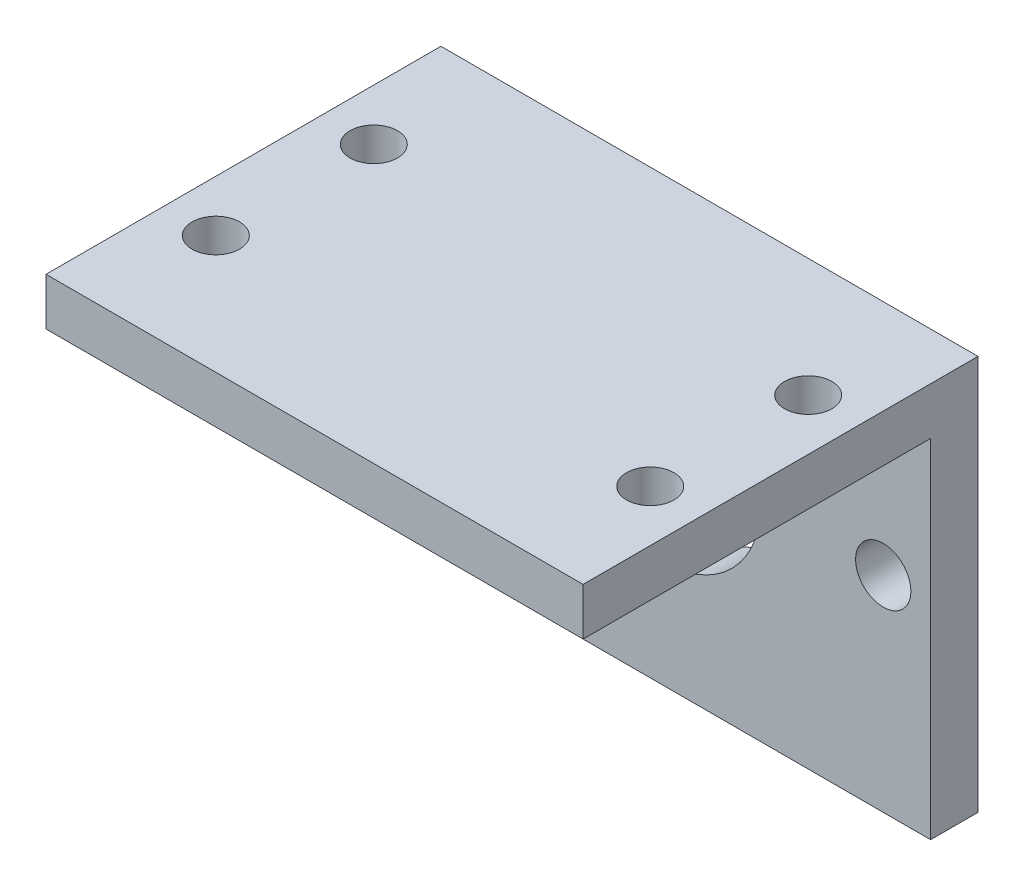
ISO-10303-21;
HEADER;
FILE_DESCRIPTION(('STEP AP214'),'2;1');
FILE_NAME('part.step','',(''),(''),'','','');
FILE_SCHEMA(('AUTOMOTIVE_DESIGN { 1 0 10303 214 1 1 1 1 }'));
ENDSEC;
DATA;
#1=APPLICATION_CONTEXT('core data for automotive mechanical design processes');
#2=APPLICATION_PROTOCOL_DEFINITION('international standard','automotive_design',2000,#1);
#3=PRODUCT_CONTEXT('',#1,'mechanical');
#4=PRODUCT('Part','Part','',(#3));
#5=PRODUCT_RELATED_PRODUCT_CATEGORY('part','',(#4));
#6=PRODUCT_DEFINITION_FORMATION('','',#4);
#7=PRODUCT_DEFINITION_CONTEXT('part definition',#1,'design');
#8=PRODUCT_DEFINITION('design','',#6,#7);
#9=PRODUCT_DEFINITION_SHAPE('','',#8);
#10=(LENGTH_UNIT() NAMED_UNIT(*) SI_UNIT(.MILLI.,.METRE.));
#11=(NAMED_UNIT(*) PLANE_ANGLE_UNIT() SI_UNIT($,.RADIAN.));
#12=(NAMED_UNIT(*) SI_UNIT($,.STERADIAN.) SOLID_ANGLE_UNIT());
#13=UNCERTAINTY_MEASURE_WITH_UNIT(LENGTH_MEASURE(1.E-05),#10,'distance_accuracy_value','');
#14=(GEOMETRIC_REPRESENTATION_CONTEXT(3) GLOBAL_UNCERTAINTY_ASSIGNED_CONTEXT((#13)) GLOBAL_UNIT_ASSIGNED_CONTEXT((#10,
#11,#12)) REPRESENTATION_CONTEXT('',''));
#15=CARTESIAN_POINT('',(0.,0.,0.));
#16=DIRECTION('',(0.,0.,1.));
#17=DIRECTION('',(1.,0.,0.));
#18=AXIS2_PLACEMENT_3D('',#15,#16,#17);
#19=CARTESIAN_POINT('',(0.,6.,0.));
#20=DIRECTION('',(0.,1.,0.));
#21=DIRECTION('',(0.,0.,1.));
#22=AXIS2_PLACEMENT_3D('',#19,#20,#21);
#23=PLANE('',#22);
#24=DIRECTION('',(0.,0.,-1.));
#25=VECTOR('',#24,1.);
#26=CARTESIAN_POINT('',(34.,6.,-50.));
#27=LINE('',#26,#25);
#28=CARTESIAN_POINT('',(34.,6.,0.));
#29=VERTEX_POINT('',#28);
#30=CARTESIAN_POINT('',(34.,6.,-50.));
#31=VERTEX_POINT('',#30);
#32=EDGE_CURVE('E155',#29,#31,#27,.T.);
#33=ORIENTED_EDGE('',*,*,#32,.T.);
#34=DIRECTION('',(-1.,0.,0.));
#35=VECTOR('',#34,1.);
#36=CARTESIAN_POINT('',(-34.,6.,-50.));
#37=LINE('',#36,#35);
#38=CARTESIAN_POINT('',(-34.,6.,-50.));
#39=VERTEX_POINT('',#38);
#40=EDGE_CURVE('E58',#31,#39,#37,.T.);
#41=ORIENTED_EDGE('',*,*,#40,.T.);
#42=DIRECTION('',(0.,0.,1.));
#43=VECTOR('',#42,1.);
#44=CARTESIAN_POINT('',(-34.,6.,-50.));
#45=LINE('',#44,#43);
#46=CARTESIAN_POINT('',(-34.,6.,0.));
#47=VERTEX_POINT('',#46);
#48=EDGE_CURVE('E78',#39,#47,#45,.T.);
#49=ORIENTED_EDGE('',*,*,#48,.T.);
#50=DIRECTION('',(1.,0.,0.));
#51=VECTOR('',#50,1.);
#52=CARTESIAN_POINT('',(-34.,6.,0.));
#53=LINE('',#52,#51);
#54=EDGE_CURVE('E152',#47,#29,#53,.T.);
#55=ORIENTED_EDGE('',*,*,#54,.T.);
#56=EDGE_LOOP('',(#33,#41,#49,#55));
#57=FACE_BOUND('',#56,.T.);
#58=CARTESIAN_POINT('',(-27.5,6.,-15.));
#59=DIRECTION('',(0.,1.,0.));
#60=DIRECTION('',(0.,0.,1.));
#61=AXIS2_PLACEMENT_3D('',#58,#59,#60);
#62=CIRCLE('',#61,3.);
#63=CARTESIAN_POINT('',(-27.5,6.,-12.));
#64=VERTEX_POINT('',#63);
#65=EDGE_CURVE('E133',#64,#64,#62,.T.);
#66=ORIENTED_EDGE('',*,*,#65,.F.);
#67=EDGE_LOOP('',(#66));
#68=FACE_BOUND('',#67,.T.);
#69=CARTESIAN_POINT('',(-27.5,6.,-35.));
#70=DIRECTION('',(0.,1.,0.));
#71=DIRECTION('',(0.,0.,1.));
#72=AXIS2_PLACEMENT_3D('',#69,#70,#71);
#73=CIRCLE('',#72,3.);
#74=CARTESIAN_POINT('',(-27.5,6.,-32.));
#75=VERTEX_POINT('',#74);
#76=EDGE_CURVE('E145',#75,#75,#73,.T.);
#77=ORIENTED_EDGE('',*,*,#76,.F.);
#78=EDGE_LOOP('',(#77));
#79=FACE_BOUND('',#78,.T.);
#80=CARTESIAN_POINT('',(27.5,6.,-35.));
#81=DIRECTION('',(0.,1.,0.));
#82=DIRECTION('',(0.,0.,1.));
#83=AXIS2_PLACEMENT_3D('',#80,#81,#82);
#84=CIRCLE('',#83,3.);
#85=CARTESIAN_POINT('',(27.5,6.,-32.));
#86=VERTEX_POINT('',#85);
#87=EDGE_CURVE('E139',#86,#86,#84,.T.);
#88=ORIENTED_EDGE('',*,*,#87,.F.);
#89=EDGE_LOOP('',(#88));
#90=FACE_BOUND('',#89,.T.);
#91=CARTESIAN_POINT('',(27.5,6.,-15.));
#92=DIRECTION('',(0.,1.,0.));
#93=DIRECTION('',(0.,0.,1.));
#94=AXIS2_PLACEMENT_3D('',#91,#92,#93);
#95=CIRCLE('',#94,3.);
#96=CARTESIAN_POINT('',(27.5,6.,-12.));
#97=VERTEX_POINT('',#96);
#98=EDGE_CURVE('E127',#97,#97,#95,.T.);
#99=ORIENTED_EDGE('',*,*,#98,.F.);
#100=EDGE_LOOP('',(#99));
#101=FACE_BOUND('',#100,.T.);
#102=ADVANCED_FACE('F34',(#57,#68,#79,#90,#101),#23,.T.);
#103=CARTESIAN_POINT('',(0.,0.,0.));
#104=DIRECTION('',(0.,1.,0.));
#105=DIRECTION('',(0.,0.,1.));
#106=AXIS2_PLACEMENT_3D('',#103,#104,#105);
#107=PLANE('',#106);
#108=CARTESIAN_POINT('',(-27.5,0.,-15.));
#109=DIRECTION('',(0.,1.,0.));
#110=DIRECTION('',(0.,0.,1.));
#111=AXIS2_PLACEMENT_3D('',#108,#109,#110);
#112=CIRCLE('',#111,3.);
#113=CARTESIAN_POINT('',(-27.5,0.,-12.));
#114=VERTEX_POINT('',#113);
#115=EDGE_CURVE('E130',#114,#114,#112,.T.);
#116=ORIENTED_EDGE('',*,*,#115,.T.);
#117=EDGE_LOOP('',(#116));
#118=FACE_BOUND('',#117,.T.);
#119=CARTESIAN_POINT('',(-27.5,0.,-35.));
#120=DIRECTION('',(0.,1.,0.));
#121=DIRECTION('',(0.,0.,1.));
#122=AXIS2_PLACEMENT_3D('',#119,#120,#121);
#123=CIRCLE('',#122,3.);
#124=CARTESIAN_POINT('',(-27.5,0.,-32.));
#125=VERTEX_POINT('',#124);
#126=EDGE_CURVE('E142',#125,#125,#123,.T.);
#127=ORIENTED_EDGE('',*,*,#126,.T.);
#128=EDGE_LOOP('',(#127));
#129=FACE_BOUND('',#128,.T.);
#130=DIRECTION('',(0.,0.,1.));
#131=VECTOR('',#130,1.);
#132=CARTESIAN_POINT('',(-34.,0.,-50.));
#133=LINE('',#132,#131);
#134=CARTESIAN_POINT('',(-34.,0.,-44.));
#135=VERTEX_POINT('',#134);
#136=CARTESIAN_POINT('',(-34.,0.,0.));
#137=VERTEX_POINT('',#136);
#138=EDGE_CURVE('E148',#135,#137,#133,.T.);
#139=ORIENTED_EDGE('',*,*,#138,.F.);
#140=DIRECTION('',(1.,0.,0.));
#141=VECTOR('',#140,1.);
#142=CARTESIAN_POINT('',(0.,0.,-44.));
#143=LINE('',#142,#141);
#144=CARTESIAN_POINT('',(34.,0.,-44.));
#145=VERTEX_POINT('',#144);
#146=EDGE_CURVE('E97',#135,#145,#143,.T.);
#147=ORIENTED_EDGE('',*,*,#146,.T.);
#148=DIRECTION('',(0.,0.,-1.));
#149=VECTOR('',#148,1.);
#150=CARTESIAN_POINT('',(34.,0.,-50.));
#151=LINE('',#150,#149);
#152=CARTESIAN_POINT('',(34.,0.,0.));
#153=VERTEX_POINT('',#152);
#154=EDGE_CURVE('E153',#153,#145,#151,.T.);
#155=ORIENTED_EDGE('',*,*,#154,.F.);
#156=DIRECTION('',(1.,0.,0.));
#157=VECTOR('',#156,1.);
#158=CARTESIAN_POINT('',(-34.,0.,0.));
#159=LINE('',#158,#157);
#160=EDGE_CURVE('E73',#137,#153,#159,.T.);
#161=ORIENTED_EDGE('',*,*,#160,.F.);
#162=EDGE_LOOP('',(#139,#147,#155,#161));
#163=FACE_BOUND('',#162,.T.);
#164=CARTESIAN_POINT('',(27.5,0.,-35.));
#165=DIRECTION('',(0.,1.,0.));
#166=DIRECTION('',(0.,0.,1.));
#167=AXIS2_PLACEMENT_3D('',#164,#165,#166);
#168=CIRCLE('',#167,3.);
#169=CARTESIAN_POINT('',(27.5,0.,-32.));
#170=VERTEX_POINT('',#169);
#171=EDGE_CURVE('E136',#170,#170,#168,.T.);
#172=ORIENTED_EDGE('',*,*,#171,.T.);
#173=EDGE_LOOP('',(#172));
#174=FACE_BOUND('',#173,.T.);
#175=CARTESIAN_POINT('',(27.5,0.,-15.));
#176=DIRECTION('',(0.,1.,0.));
#177=DIRECTION('',(0.,0.,1.));
#178=AXIS2_PLACEMENT_3D('',#175,#176,#177);
#179=CIRCLE('',#178,3.);
#180=CARTESIAN_POINT('',(27.5,0.,-12.));
#181=VERTEX_POINT('',#180);
#182=EDGE_CURVE('E126',#181,#181,#179,.T.);
#183=ORIENTED_EDGE('',*,*,#182,.T.);
#184=EDGE_LOOP('',(#183));
#185=FACE_BOUND('',#184,.T.);
#186=ADVANCED_FACE('F170',(#118,#129,#163,#174,#185),#107,.F.);
#187=CARTESIAN_POINT('',(-34.,6.,-50.));
#188=DIRECTION('',(1.,0.,0.));
#189=DIRECTION('',(0.,0.,-1.));
#190=AXIS2_PLACEMENT_3D('',#187,#188,#189);
#191=PLANE('',#190);
#192=DIRECTION('',(0.,-1.,0.));
#193=VECTOR('',#192,1.);
#194=CARTESIAN_POINT('',(-34.,6.,0.));
#195=LINE('',#194,#193);
#196=EDGE_CURVE('E11',#47,#137,#195,.T.);
#197=ORIENTED_EDGE('',*,*,#196,.F.);
#198=ORIENTED_EDGE('',*,*,#48,.F.);
#199=DIRECTION('',(0.,-1.,0.));
#200=VECTOR('',#199,1.);
#201=CARTESIAN_POINT('',(-34.,6.,-50.));
#202=LINE('',#201,#200);
#203=CARTESIAN_POINT('',(-34.,-44.,-50.));
#204=VERTEX_POINT('',#203);
#205=EDGE_CURVE('E114',#39,#204,#202,.T.);
#206=ORIENTED_EDGE('',*,*,#205,.T.);
#207=DIRECTION('',(0.,0.,1.));
#208=VECTOR('',#207,1.);
#209=CARTESIAN_POINT('',(-34.,-44.,-50.));
#210=LINE('',#209,#208);
#211=CARTESIAN_POINT('',(-34.,-44.,-44.));
#212=VERTEX_POINT('',#211);
#213=EDGE_CURVE('E108',#204,#212,#210,.T.);
#214=ORIENTED_EDGE('',*,*,#213,.T.);
#215=DIRECTION('',(0.,1.,0.));
#216=VECTOR('',#215,1.);
#217=CARTESIAN_POINT('',(-34.,-44.,-44.));
#218=LINE('',#217,#216);
#219=EDGE_CURVE('E93',#212,#135,#218,.T.);
#220=ORIENTED_EDGE('',*,*,#219,.T.);
#221=ORIENTED_EDGE('',*,*,#138,.T.);
#222=EDGE_LOOP('',(#197,#198,#206,#214,#220,#221));
#223=FACE_BOUND('',#222,.T.);
#224=ADVANCED_FACE('F36',(#223),#191,.F.);
#225=CARTESIAN_POINT('',(-34.,6.,0.));
#226=DIRECTION('',(0.,0.,-1.));
#227=DIRECTION('',(-1.,0.,0.));
#228=AXIS2_PLACEMENT_3D('',#225,#226,#227);
#229=PLANE('',#228);
#230=ORIENTED_EDGE('',*,*,#160,.T.);
#231=DIRECTION('',(0.,-1.,0.));
#232=VECTOR('',#231,1.);
#233=CARTESIAN_POINT('',(34.,6.,0.));
#234=LINE('',#233,#232);
#235=EDGE_CURVE('E42',#29,#153,#234,.T.);
#236=ORIENTED_EDGE('',*,*,#235,.F.);
#237=ORIENTED_EDGE('',*,*,#54,.F.);
#238=ORIENTED_EDGE('',*,*,#196,.T.);
#239=EDGE_LOOP('',(#230,#236,#237,#238));
#240=FACE_BOUND('',#239,.T.);
#241=ADVANCED_FACE('F172',(#240),#229,.F.);
#242=CARTESIAN_POINT('',(34.,6.,-50.));
#243=DIRECTION('',(-1.,0.,0.));
#244=DIRECTION('',(0.,0.,1.));
#245=AXIS2_PLACEMENT_3D('',#242,#243,#244);
#246=PLANE('',#245);
#247=ORIENTED_EDGE('',*,*,#154,.T.);
#248=DIRECTION('',(0.,1.,0.));
#249=VECTOR('',#248,1.);
#250=CARTESIAN_POINT('',(34.,-44.,-44.));
#251=LINE('',#250,#249);
#252=CARTESIAN_POINT('',(34.,-44.,-44.));
#253=VERTEX_POINT('',#252);
#254=EDGE_CURVE('E49',#253,#145,#251,.T.);
#255=ORIENTED_EDGE('',*,*,#254,.F.);
#256=DIRECTION('',(0.,0.,-1.));
#257=VECTOR('',#256,1.);
#258=CARTESIAN_POINT('',(34.,-44.,-50.));
#259=LINE('',#258,#257);
#260=CARTESIAN_POINT('',(34.,-44.,-50.));
#261=VERTEX_POINT('',#260);
#262=EDGE_CURVE('E111',#253,#261,#259,.T.);
#263=ORIENTED_EDGE('',*,*,#262,.T.);
#264=DIRECTION('',(0.,-1.,0.));
#265=VECTOR('',#264,1.);
#266=CARTESIAN_POINT('',(34.,6.,-50.));
#267=LINE('',#266,#265);
#268=EDGE_CURVE('E163',#31,#261,#267,.T.);
#269=ORIENTED_EDGE('',*,*,#268,.F.);
#270=ORIENTED_EDGE('',*,*,#32,.F.);
#271=ORIENTED_EDGE('',*,*,#235,.T.);
#272=EDGE_LOOP('',(#247,#255,#263,#269,#270,#271));
#273=FACE_BOUND('',#272,.T.);
#274=ADVANCED_FACE('F167',(#273),#246,.F.);
#275=CARTESIAN_POINT('',(-34.,6.,-50.));
#276=DIRECTION('',(0.,0.,1.));
#277=DIRECTION('',(1.,0.,0.));
#278=AXIS2_PLACEMENT_3D('',#275,#276,#277);
#279=PLANE('',#278);
#280=CARTESIAN_POINT('',(-28.,-18.,-50.));
#281=DIRECTION('',(0.,0.,1.));
#282=DIRECTION('',(1.,0.,0.));
#283=AXIS2_PLACEMENT_3D('',#280,#281,#282);
#284=CIRCLE('',#283,3.5);
#285=CARTESIAN_POINT('',(-24.5,-18.,-50.));
#286=VERTEX_POINT('',#285);
#287=EDGE_CURVE('E232',#286,#286,#284,.F.);
#288=ORIENTED_EDGE('',*,*,#287,.F.);
#289=EDGE_LOOP('',(#288));
#290=FACE_BOUND('',#289,.T.);
#291=CARTESIAN_POINT('',(28.,-18.,-50.));
#292=DIRECTION('',(0.,0.,1.));
#293=DIRECTION('',(1.,0.,0.));
#294=AXIS2_PLACEMENT_3D('',#291,#292,#293);
#295=CIRCLE('',#294,3.5);
#296=CARTESIAN_POINT('',(31.5,-18.,-50.));
#297=VERTEX_POINT('',#296);
#298=EDGE_CURVE('E236',#297,#297,#295,.F.);
#299=ORIENTED_EDGE('',*,*,#298,.F.);
#300=EDGE_LOOP('',(#299));
#301=FACE_BOUND('',#300,.T.);
#302=CARTESIAN_POINT('',(0.,-18.,-50.));
#303=DIRECTION('',(0.,0.,1.));
#304=DIRECTION('',(1.,0.,0.));
#305=AXIS2_PLACEMENT_3D('',#302,#303,#304);
#306=CIRCLE('',#305,12.5);
#307=CARTESIAN_POINT('',(12.5,-18.,-50.));
#308=VERTEX_POINT('',#307);
#309=EDGE_CURVE('E115',#308,#308,#306,.F.);
#310=ORIENTED_EDGE('',*,*,#309,.F.);
#311=EDGE_LOOP('',(#310));
#312=FACE_BOUND('',#311,.T.);
#313=ORIENTED_EDGE('',*,*,#268,.T.);
#314=DIRECTION('',(-1.,0.,0.));
#315=VECTOR('',#314,1.);
#316=CARTESIAN_POINT('',(-34.,-44.,-50.));
#317=LINE('',#316,#315);
#318=EDGE_CURVE('E101',#261,#204,#317,.T.);
#319=ORIENTED_EDGE('',*,*,#318,.T.);
#320=ORIENTED_EDGE('',*,*,#205,.F.);
#321=ORIENTED_EDGE('',*,*,#40,.F.);
#322=EDGE_LOOP('',(#313,#319,#320,#321));
#323=FACE_BOUND('',#322,.T.);
#324=ADVANCED_FACE('F175',(#290,#301,#312,#323),#279,.F.);
#325=CARTESIAN_POINT('',(-27.5,6.,-35.));
#326=DIRECTION('',(0.,-1.,0.));
#327=DIRECTION('',(0.,0.,-1.));
#328=AXIS2_PLACEMENT_3D('',#325,#326,#327);
#329=CYLINDRICAL_SURFACE('',#328,3.);
#330=ORIENTED_EDGE('',*,*,#76,.T.);
#331=EDGE_LOOP('',(#330));
#332=FACE_BOUND('',#331,.T.);
#333=ORIENTED_EDGE('',*,*,#126,.F.);
#334=EDGE_LOOP('',(#333));
#335=FACE_BOUND('',#334,.T.);
#336=ADVANCED_FACE('F177',(#332,#335),#329,.F.);
#337=CARTESIAN_POINT('',(27.5,6.,-35.));
#338=DIRECTION('',(0.,-1.,0.));
#339=DIRECTION('',(0.,0.,-1.));
#340=AXIS2_PLACEMENT_3D('',#337,#338,#339);
#341=CYLINDRICAL_SURFACE('',#340,3.);
#342=ORIENTED_EDGE('',*,*,#87,.T.);
#343=EDGE_LOOP('',(#342));
#344=FACE_BOUND('',#343,.T.);
#345=ORIENTED_EDGE('',*,*,#171,.F.);
#346=EDGE_LOOP('',(#345));
#347=FACE_BOUND('',#346,.T.);
#348=ADVANCED_FACE('F184',(#344,#347),#341,.F.);
#349=CARTESIAN_POINT('',(-27.5,6.,-15.));
#350=DIRECTION('',(0.,-1.,0.));
#351=DIRECTION('',(0.,0.,-1.));
#352=AXIS2_PLACEMENT_3D('',#349,#350,#351);
#353=CYLINDRICAL_SURFACE('',#352,3.);
#354=ORIENTED_EDGE('',*,*,#65,.T.);
#355=EDGE_LOOP('',(#354));
#356=FACE_BOUND('',#355,.T.);
#357=ORIENTED_EDGE('',*,*,#115,.F.);
#358=EDGE_LOOP('',(#357));
#359=FACE_BOUND('',#358,.T.);
#360=ADVANCED_FACE('F200',(#356,#359),#353,.F.);
#361=CARTESIAN_POINT('',(27.5,6.,-15.));
#362=DIRECTION('',(0.,-1.,0.));
#363=DIRECTION('',(0.,0.,-1.));
#364=AXIS2_PLACEMENT_3D('',#361,#362,#363);
#365=CYLINDRICAL_SURFACE('',#364,3.);
#366=ORIENTED_EDGE('',*,*,#98,.T.);
#367=EDGE_LOOP('',(#366));
#368=FACE_BOUND('',#367,.T.);
#369=ORIENTED_EDGE('',*,*,#182,.F.);
#370=EDGE_LOOP('',(#369));
#371=FACE_BOUND('',#370,.T.);
#372=ADVANCED_FACE('F204',(#368,#371),#365,.F.);
#373=CARTESIAN_POINT('',(-34.,-44.,-44.));
#374=DIRECTION('',(0.,0.,1.));
#375=DIRECTION('',(1.,0.,0.));
#376=AXIS2_PLACEMENT_3D('',#373,#374,#375);
#377=PLANE('',#376);
#378=CARTESIAN_POINT('',(-28.,-18.,-44.));
#379=DIRECTION('',(0.,0.,1.));
#380=DIRECTION('',(-1.,0.,0.));
#381=AXIS2_PLACEMENT_3D('',#378,#379,#380);
#382=CIRCLE('',#381,3.5);
#383=CARTESIAN_POINT('',(-31.5,-18.,-44.));
#384=VERTEX_POINT('',#383);
#385=EDGE_CURVE('E230',#384,#384,#382,.T.);
#386=ORIENTED_EDGE('',*,*,#385,.F.);
#387=EDGE_LOOP('',(#386));
#388=FACE_BOUND('',#387,.T.);
#389=CARTESIAN_POINT('',(28.,-18.,-44.));
#390=DIRECTION('',(0.,0.,1.));
#391=DIRECTION('',(1.,0.,0.));
#392=AXIS2_PLACEMENT_3D('',#389,#390,#391);
#393=CIRCLE('',#392,3.5);
#394=CARTESIAN_POINT('',(31.5,-18.,-44.));
#395=VERTEX_POINT('',#394);
#396=EDGE_CURVE('E233',#395,#395,#393,.T.);
#397=ORIENTED_EDGE('',*,*,#396,.F.);
#398=EDGE_LOOP('',(#397));
#399=FACE_BOUND('',#398,.T.);
#400=CARTESIAN_POINT('',(0.,-18.,-44.));
#401=DIRECTION('',(0.,0.,1.));
#402=DIRECTION('',(1.,0.,0.));
#403=AXIS2_PLACEMENT_3D('',#400,#401,#402);
#404=CIRCLE('',#403,12.5);
#405=CARTESIAN_POINT('',(12.5,-18.,-44.));
#406=VERTEX_POINT('',#405);
#407=EDGE_CURVE('E118',#406,#406,#404,.T.);
#408=ORIENTED_EDGE('',*,*,#407,.F.);
#409=EDGE_LOOP('',(#408));
#410=FACE_BOUND('',#409,.T.);
#411=ORIENTED_EDGE('',*,*,#146,.F.);
#412=ORIENTED_EDGE('',*,*,#219,.F.);
#413=DIRECTION('',(1.,0.,0.));
#414=VECTOR('',#413,1.);
#415=CARTESIAN_POINT('',(-34.,-44.,-44.));
#416=LINE('',#415,#414);
#417=EDGE_CURVE('E96',#212,#253,#416,.T.);
#418=ORIENTED_EDGE('',*,*,#417,.T.);
#419=ORIENTED_EDGE('',*,*,#254,.T.);
#420=EDGE_LOOP('',(#411,#412,#418,#419));
#421=FACE_BOUND('',#420,.T.);
#422=ADVANCED_FACE('F95',(#388,#399,#410,#421),#377,.T.);
#423=CARTESIAN_POINT('',(0.,-44.,0.));
#424=DIRECTION('',(0.,1.,0.));
#425=DIRECTION('',(0.,0.,1.));
#426=AXIS2_PLACEMENT_3D('',#423,#424,#425);
#427=PLANE('',#426);
#428=ORIENTED_EDGE('',*,*,#213,.F.);
#429=ORIENTED_EDGE('',*,*,#318,.F.);
#430=ORIENTED_EDGE('',*,*,#262,.F.);
#431=ORIENTED_EDGE('',*,*,#417,.F.);
#432=EDGE_LOOP('',(#428,#429,#430,#431));
#433=FACE_BOUND('',#432,.T.);
#434=ADVANCED_FACE('F106',(#433),#427,.F.);
#435=CARTESIAN_POINT('',(0.,-18.,-50.001));
#436=DIRECTION('',(0.,0.,1.));
#437=DIRECTION('',(1.,0.,0.));
#438=AXIS2_PLACEMENT_3D('',#435,#436,#437);
#439=CYLINDRICAL_SURFACE('',#438,12.5);
#440=ORIENTED_EDGE('',*,*,#407,.T.);
#441=EDGE_LOOP('',(#440));
#442=FACE_BOUND('',#441,.T.);
#443=ORIENTED_EDGE('',*,*,#309,.T.);
#444=EDGE_LOOP('',(#443));
#445=FACE_BOUND('',#444,.T.);
#446=ADVANCED_FACE('F214',(#442,#445),#439,.F.);
#447=CARTESIAN_POINT('',(28.,-18.,-50.001));
#448=DIRECTION('',(0.,0.,1.));
#449=DIRECTION('',(1.,0.,0.));
#450=AXIS2_PLACEMENT_3D('',#447,#448,#449);
#451=CYLINDRICAL_SURFACE('',#450,3.5);
#452=ORIENTED_EDGE('',*,*,#396,.T.);
#453=EDGE_LOOP('',(#452));
#454=FACE_BOUND('',#453,.T.);
#455=ORIENTED_EDGE('',*,*,#298,.T.);
#456=EDGE_LOOP('',(#455));
#457=FACE_BOUND('',#456,.T.);
#458=ADVANCED_FACE('F217',(#454,#457),#451,.F.);
#459=CARTESIAN_POINT('',(-28.,-18.,-50.001));
#460=DIRECTION('',(0.,0.,1.));
#461=DIRECTION('',(1.,0.,0.));
#462=AXIS2_PLACEMENT_3D('',#459,#460,#461);
#463=CYLINDRICAL_SURFACE('',#462,3.5);
#464=ORIENTED_EDGE('',*,*,#385,.T.);
#465=EDGE_LOOP('',(#464));
#466=FACE_BOUND('',#465,.T.);
#467=ORIENTED_EDGE('',*,*,#287,.T.);
#468=EDGE_LOOP('',(#467));
#469=FACE_BOUND('',#468,.T.);
#470=ADVANCED_FACE('F221',(#466,#469),#463,.F.);
#471=CLOSED_SHELL('',(#102,#186,#224,#241,#274,#324,#336,#348,#360,#372,#422,#434,#446,#458,#470));
#472=MANIFOLD_SOLID_BREP('B2',#471);
#473=ADVANCED_BREP_SHAPE_REPRESENTATION('',(#18,#472),#14);
#474=SHAPE_DEFINITION_REPRESENTATION(#9,#473);
ENDSEC;
END-ISO-10303-21;
